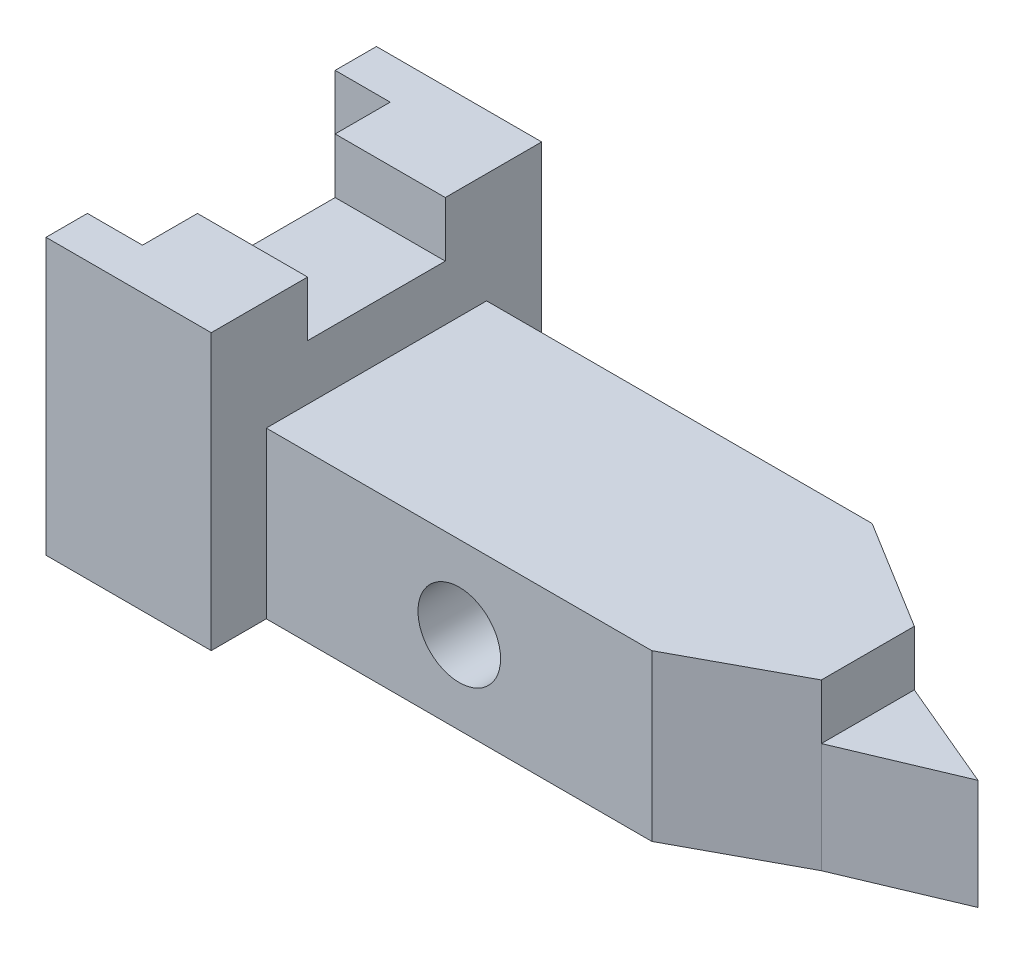
ISO-10303-21;
HEADER;
FILE_DESCRIPTION(('STEP AP214'),'2;1');
FILE_NAME('part.step','',(''),(''),'','','');
FILE_SCHEMA(('AUTOMOTIVE_DESIGN { 1 0 10303 214 1 1 1 1 }'));
ENDSEC;
DATA;
#1=APPLICATION_CONTEXT('core data for automotive mechanical design processes');
#2=APPLICATION_PROTOCOL_DEFINITION('international standard','automotive_design',2000,#1);
#3=PRODUCT_CONTEXT('',#1,'mechanical');
#4=PRODUCT('Part','Part','',(#3));
#5=PRODUCT_RELATED_PRODUCT_CATEGORY('part','',(#4));
#6=PRODUCT_DEFINITION_FORMATION('','',#4);
#7=PRODUCT_DEFINITION_CONTEXT('part definition',#1,'design');
#8=PRODUCT_DEFINITION('design','',#6,#7);
#9=PRODUCT_DEFINITION_SHAPE('','',#8);
#10=(LENGTH_UNIT() NAMED_UNIT(*) SI_UNIT(.MILLI.,.METRE.));
#11=(NAMED_UNIT(*) PLANE_ANGLE_UNIT() SI_UNIT($,.RADIAN.));
#12=(NAMED_UNIT(*) SI_UNIT($,.STERADIAN.) SOLID_ANGLE_UNIT());
#13=UNCERTAINTY_MEASURE_WITH_UNIT(LENGTH_MEASURE(1.E-05),#10,'distance_accuracy_value','');
#14=(GEOMETRIC_REPRESENTATION_CONTEXT(3) GLOBAL_UNCERTAINTY_ASSIGNED_CONTEXT((#13)) GLOBAL_UNIT_ASSIGNED_CONTEXT((#10,
#11,#12)) REPRESENTATION_CONTEXT('',''));
#15=CARTESIAN_POINT('',(0.,0.,0.));
#16=DIRECTION('',(0.,0.,1.));
#17=DIRECTION('',(1.,0.,0.));
#18=AXIS2_PLACEMENT_3D('',#15,#16,#17);
#19=CARTESIAN_POINT('',(-30.,-50.,-8.98203592814371));
#20=DIRECTION('',(-1.,0.,0.));
#21=DIRECTION('',(0.,0.,1.));
#22=AXIS2_PLACEMENT_3D('',#19,#20,#21);
#23=PLANE('',#22);
#24=DIRECTION('',(0.,0.,1.));
#25=VECTOR('',#24,1.);
#26=CARTESIAN_POINT('',(-30.,-50.,-8.98203592814371));
#27=LINE('',#26,#25);
#28=CARTESIAN_POINT('',(-30.,-50.,-8.98203592814371));
#29=VERTEX_POINT('',#28);
#30=CARTESIAN_POINT('',(-30.,-50.,-1.48203592814371));
#31=VERTEX_POINT('',#30);
#32=EDGE_CURVE('E208',#29,#31,#27,.T.);
#33=ORIENTED_EDGE('',*,*,#32,.T.);
#34=DIRECTION('',(0.,1.,0.));
#35=VECTOR('',#34,1.);
#36=CARTESIAN_POINT('',(-30.,-10.,-1.48203592814371));
#37=LINE('',#36,#35);
#38=CARTESIAN_POINT('',(-30.,0.,-1.48203592814371));
#39=VERTEX_POINT('',#38);
#40=EDGE_CURVE('E191',#31,#39,#37,.T.);
#41=ORIENTED_EDGE('',*,*,#40,.T.);
#42=DIRECTION('',(0.,0.,1.));
#43=VECTOR('',#42,1.);
#44=CARTESIAN_POINT('',(-30.,0.,-8.98203592814371));
#45=LINE('',#44,#43);
#46=CARTESIAN_POINT('',(-30.,0.,-8.98203592814371));
#47=VERTEX_POINT('',#46);
#48=EDGE_CURVE('E233',#47,#39,#45,.T.);
#49=ORIENTED_EDGE('',*,*,#48,.F.);
#50=DIRECTION('',(0.,1.,0.));
#51=VECTOR('',#50,1.);
#52=CARTESIAN_POINT('',(-30.,-50.,-8.98203592814371));
#53=LINE('',#52,#51);
#54=EDGE_CURVE('E245',#29,#47,#53,.T.);
#55=ORIENTED_EDGE('',*,*,#54,.F.);
#56=EDGE_LOOP('',(#33,#41,#49,#55));
#57=FACE_BOUND('',#56,.T.);
#58=ADVANCED_FACE('F41',(#57),#23,.T.);
#59=DIRECTION('',(0.,1.,0.));
#60=VECTOR('',#59,1.);
#61=CARTESIAN_POINT('',(-30.,-10.,43.5015247734227));
#62=LINE('',#61,#60);
#63=CARTESIAN_POINT('',(-30.,-50.,43.5015247734227));
#64=VERTEX_POINT('',#63);
#65=CARTESIAN_POINT('',(-30.,0.,43.5015247734227));
#66=VERTEX_POINT('',#65);
#67=EDGE_CURVE('E179',#64,#66,#62,.T.);
#68=ORIENTED_EDGE('',*,*,#67,.F.);
#69=CARTESIAN_POINT('',(-30.,-50.,51.0179640718563));
#70=VERTEX_POINT('',#69);
#71=EDGE_CURVE('E183',#64,#70,#27,.T.);
#72=ORIENTED_EDGE('',*,*,#71,.T.);
#73=DIRECTION('',(0.,1.,0.));
#74=VECTOR('',#73,1.);
#75=CARTESIAN_POINT('',(-30.,-50.,51.0179640718563));
#76=LINE('',#75,#74);
#77=CARTESIAN_POINT('',(-30.,0.,51.0179640718563));
#78=VERTEX_POINT('',#77);
#79=EDGE_CURVE('E232',#70,#78,#76,.T.);
#80=ORIENTED_EDGE('',*,*,#79,.T.);
#81=EDGE_CURVE('E185',#66,#78,#45,.T.);
#82=ORIENTED_EDGE('',*,*,#81,.F.);
#83=EDGE_LOOP('',(#68,#72,#80,#82));
#84=FACE_BOUND('',#83,.T.);
#85=ADVANCED_FACE('F43',(#84),#23,.T.);
#86=CARTESIAN_POINT('',(0.,0.,0.));
#87=DIRECTION('',(0.,1.,0.));
#88=DIRECTION('',(0.,0.,1.));
#89=AXIS2_PLACEMENT_3D('',#86,#87,#88);
#90=PLANE('',#89);
#91=DIRECTION('',(1.,0.,0.));
#92=VECTOR('',#91,1.);
#93=CARTESIAN_POINT('',(0.,0.,33.5179640718563));
#94=LINE('',#93,#92);
#95=CARTESIAN_POINT('',(-20.,0.,33.5179640718563));
#96=VERTEX_POINT('',#95);
#97=CARTESIAN_POINT('',(0.,0.,33.5179640718563));
#98=VERTEX_POINT('',#97);
#99=EDGE_CURVE('E404',#96,#98,#94,.T.);
#100=ORIENTED_EDGE('',*,*,#99,.F.);
#101=DIRECTION('',(0.,0.,1.));
#102=VECTOR('',#101,1.);
#103=CARTESIAN_POINT('',(-20.,0.,0.));
#104=LINE('',#103,#102);
#105=CARTESIAN_POINT('',(-20.,0.,43.5015247734227));
#106=VERTEX_POINT('',#105);
#107=EDGE_CURVE('E407',#96,#106,#104,.T.);
#108=ORIENTED_EDGE('',*,*,#107,.T.);
#109=DIRECTION('',(-1.,0.,0.));
#110=VECTOR('',#109,1.);
#111=CARTESIAN_POINT('',(0.,0.,43.5015247734227));
#112=LINE('',#111,#110);
#113=EDGE_CURVE('E411',#106,#66,#112,.T.);
#114=ORIENTED_EDGE('',*,*,#113,.T.);
#115=ORIENTED_EDGE('',*,*,#81,.T.);
#116=DIRECTION('',(1.,0.,0.));
#117=VECTOR('',#116,1.);
#118=CARTESIAN_POINT('',(-30.,0.,51.0179640718563));
#119=LINE('',#118,#117);
#120=CARTESIAN_POINT('',(0.,0.,51.0179640718563));
#121=VERTEX_POINT('',#120);
#122=EDGE_CURVE('E237',#78,#121,#119,.T.);
#123=ORIENTED_EDGE('',*,*,#122,.T.);
#124=DIRECTION('',(0.,0.,-1.));
#125=VECTOR('',#124,1.);
#126=CARTESIAN_POINT('',(0.,0.,-8.98203592814371));
#127=LINE('',#126,#125);
#128=EDGE_CURVE('E215',#121,#98,#127,.T.);
#129=ORIENTED_EDGE('',*,*,#128,.T.);
#130=EDGE_LOOP('',(#100,#108,#114,#115,#123,#129));
#131=FACE_BOUND('',#130,.T.);
#132=ADVANCED_FACE('F443',(#131),#90,.T.);
#133=CARTESIAN_POINT('',(-30.,-50.,-8.98203592814371));
#134=DIRECTION('',(0.,0.,-1.));
#135=DIRECTION('',(-1.,0.,0.));
#136=AXIS2_PLACEMENT_3D('',#133,#134,#135);
#137=PLANE('',#136);
#138=DIRECTION('',(-1.,0.,0.));
#139=VECTOR('',#138,1.);
#140=CARTESIAN_POINT('',(-30.,0.,-8.98203592814371));
#141=LINE('',#140,#139);
#142=CARTESIAN_POINT('',(0.,0.,-8.98203592814371));
#143=VERTEX_POINT('',#142);
#144=EDGE_CURVE('E209',#143,#47,#141,.T.);
#145=ORIENTED_EDGE('',*,*,#144,.F.);
#146=DIRECTION('',(0.,1.,0.));
#147=VECTOR('',#146,1.);
#148=CARTESIAN_POINT('',(0.,-50.,-8.98203592814371));
#149=LINE('',#148,#147);
#150=CARTESIAN_POINT('',(0.,-50.,-8.98203592814371));
#151=VERTEX_POINT('',#150);
#152=EDGE_CURVE('E249',#151,#143,#149,.T.);
#153=ORIENTED_EDGE('',*,*,#152,.F.);
#154=DIRECTION('',(-1.,0.,0.));
#155=VECTOR('',#154,1.);
#156=CARTESIAN_POINT('',(-30.,-50.,-8.98203592814371));
#157=LINE('',#156,#155);
#158=EDGE_CURVE('E228',#151,#29,#157,.T.);
#159=ORIENTED_EDGE('',*,*,#158,.T.);
#160=ORIENTED_EDGE('',*,*,#54,.T.);
#161=EDGE_LOOP('',(#145,#153,#159,#160));
#162=FACE_BOUND('',#161,.T.);
#163=ADVANCED_FACE('F281',(#162),#137,.T.);
#164=CARTESIAN_POINT('',(0.,-50.,-8.98203592814371));
#165=DIRECTION('',(1.,0.,0.));
#166=DIRECTION('',(0.,0.,-1.));
#167=AXIS2_PLACEMENT_3D('',#164,#165,#166);
#168=PLANE('',#167);
#169=DIRECTION('',(0.,1.,0.));
#170=VECTOR('',#169,1.);
#171=CARTESIAN_POINT('',(0.,-10.,8.51796407185629));
#172=LINE('',#171,#170);
#173=CARTESIAN_POINT('',(0.,-10.,8.51796407185629));
#174=VERTEX_POINT('',#173);
#175=CARTESIAN_POINT('',(0.,0.,8.51796407185629));
#176=VERTEX_POINT('',#175);
#177=EDGE_CURVE('E374',#174,#176,#172,.T.);
#178=ORIENTED_EDGE('',*,*,#177,.F.);
#179=DIRECTION('',(0.,0.,-1.));
#180=VECTOR('',#179,1.);
#181=CARTESIAN_POINT('',(0.,-10.,0.));
#182=LINE('',#181,#180);
#183=CARTESIAN_POINT('',(0.,-10.,33.5179640718563));
#184=VERTEX_POINT('',#183);
#185=EDGE_CURVE('E395',#184,#174,#182,.T.);
#186=ORIENTED_EDGE('',*,*,#185,.F.);
#187=DIRECTION('',(0.,1.,0.));
#188=VECTOR('',#187,1.);
#189=CARTESIAN_POINT('',(0.,-10.,33.5179640718563));
#190=LINE('',#189,#188);
#191=EDGE_CURVE('E377',#184,#98,#190,.T.);
#192=ORIENTED_EDGE('',*,*,#191,.T.);
#193=ORIENTED_EDGE('',*,*,#128,.F.);
#194=DIRECTION('',(0.,1.,0.));
#195=VECTOR('',#194,1.);
#196=CARTESIAN_POINT('',(0.,-50.,51.0179640718563));
#197=LINE('',#196,#195);
#198=CARTESIAN_POINT('',(0.,-50.,51.0179640718563));
#199=VERTEX_POINT('',#198);
#200=EDGE_CURVE('E253',#199,#121,#197,.T.);
#201=ORIENTED_EDGE('',*,*,#200,.F.);
#202=DIRECTION('',(0.,0.,-1.));
#203=VECTOR('',#202,1.);
#204=CARTESIAN_POINT('',(0.,-50.,-8.98203592814371));
#205=LINE('',#204,#203);
#206=CARTESIAN_POINT('',(0.,-50.,41.0179640718563));
#207=VERTEX_POINT('',#206);
#208=EDGE_CURVE('E224',#199,#207,#205,.T.);
#209=ORIENTED_EDGE('',*,*,#208,.T.);
#210=DIRECTION('',(0.,-1.,0.));
#211=VECTOR('',#210,1.);
#212=CARTESIAN_POINT('',(0.,-50.,41.0179640718563));
#213=LINE('',#212,#211);
#214=CARTESIAN_POINT('',(0.,-20.,41.0179640718563));
#215=VERTEX_POINT('',#214);
#216=EDGE_CURVE('E309',#215,#207,#213,.T.);
#217=ORIENTED_EDGE('',*,*,#216,.F.);
#218=DIRECTION('',(0.,0.,1.));
#219=VECTOR('',#218,1.);
#220=CARTESIAN_POINT('',(0.,-20.,41.0179640718563));
#221=LINE('',#220,#219);
#222=CARTESIAN_POINT('',(0.,-20.,1.01796407185629));
#223=VERTEX_POINT('',#222);
#224=EDGE_CURVE('E313',#223,#215,#221,.T.);
#225=ORIENTED_EDGE('',*,*,#224,.F.);
#226=DIRECTION('',(0.,1.,0.));
#227=VECTOR('',#226,1.);
#228=CARTESIAN_POINT('',(0.,-20.,1.01796407185629));
#229=LINE('',#228,#227);
#230=CARTESIAN_POINT('',(0.,-50.,1.01796407185628));
#231=VERTEX_POINT('',#230);
#232=EDGE_CURVE('E277',#231,#223,#229,.T.);
#233=ORIENTED_EDGE('',*,*,#232,.F.);
#234=EDGE_CURVE('E223',#231,#151,#205,.T.);
#235=ORIENTED_EDGE('',*,*,#234,.T.);
#236=ORIENTED_EDGE('',*,*,#152,.T.);
#237=EDGE_CURVE('E241',#176,#143,#127,.T.);
#238=ORIENTED_EDGE('',*,*,#237,.F.);
#239=EDGE_LOOP('',(#178,#186,#192,#193,#201,#209,#217,#225,#233,#235,#236,#238));
#240=FACE_BOUND('',#239,.T.);
#241=ADVANCED_FACE('F272',(#240),#168,.T.);
#242=CARTESIAN_POINT('',(-30.,-50.,51.0179640718563));
#243=DIRECTION('',(0.,0.,1.));
#244=DIRECTION('',(1.,0.,0.));
#245=AXIS2_PLACEMENT_3D('',#242,#243,#244);
#246=PLANE('',#245);
#247=ORIENTED_EDGE('',*,*,#122,.F.);
#248=ORIENTED_EDGE('',*,*,#79,.F.);
#249=DIRECTION('',(1.,0.,0.));
#250=VECTOR('',#249,1.);
#251=CARTESIAN_POINT('',(-30.,-50.,51.0179640718563));
#252=LINE('',#251,#250);
#253=EDGE_CURVE('E206',#70,#199,#252,.T.);
#254=ORIENTED_EDGE('',*,*,#253,.T.);
#255=ORIENTED_EDGE('',*,*,#200,.T.);
#256=EDGE_LOOP('',(#247,#248,#254,#255));
#257=FACE_BOUND('',#256,.T.);
#258=ADVANCED_FACE('F464',(#257),#246,.T.);
#259=CARTESIAN_POINT('',(0.,-50.,0.));
#260=DIRECTION('',(0.,1.,0.));
#261=DIRECTION('',(0.,0.,1.));
#262=AXIS2_PLACEMENT_3D('',#259,#260,#261);
#263=PLANE('',#262);
#264=DIRECTION('',(0.,0.,-1.));
#265=VECTOR('',#264,1.);
#266=CARTESIAN_POINT('',(-20.,-50.,0.));
#267=LINE('',#266,#265);
#268=CARTESIAN_POINT('',(-20.,-50.,43.5015247734227));
#269=VERTEX_POINT('',#268);
#270=CARTESIAN_POINT('',(-20.,-50.,-1.48203592814371));
#271=VERTEX_POINT('',#270);
#272=EDGE_CURVE('E200',#269,#271,#267,.T.);
#273=ORIENTED_EDGE('',*,*,#272,.T.);
#274=DIRECTION('',(-1.,0.,0.));
#275=VECTOR('',#274,1.);
#276=CARTESIAN_POINT('',(0.,-50.,-1.48203592814371));
#277=LINE('',#276,#275);
#278=EDGE_CURVE('E285',#271,#31,#277,.T.);
#279=ORIENTED_EDGE('',*,*,#278,.T.);
#280=ORIENTED_EDGE('',*,*,#32,.F.);
#281=ORIENTED_EDGE('',*,*,#158,.F.);
#282=ORIENTED_EDGE('',*,*,#234,.F.);
#283=DIRECTION('',(-1.,0.,0.));
#284=VECTOR('',#283,1.);
#285=CARTESIAN_POINT('',(90.,-50.,1.01796407185627));
#286=LINE('',#285,#284);
#287=CARTESIAN_POINT('',(70.,-50.,1.01796407185627));
#288=VERTEX_POINT('',#287);
#289=EDGE_CURVE('E219',#288,#231,#286,.T.);
#290=ORIENTED_EDGE('',*,*,#289,.F.);
#291=DIRECTION('',(0.851136331949679,0.,0.524944706074122));
#292=VECTOR('',#291,1.);
#293=CARTESIAN_POINT('',(18.8348602603311,-50.,-30.5385189892732));
#294=LINE('',#293,#292);
#295=CARTESIAN_POINT('',(90.,-50.,13.3531138326858));
#296=VERTEX_POINT('',#295);
#297=EDGE_CURVE('E327',#288,#296,#294,.T.);
#298=ORIENTED_EDGE('',*,*,#297,.T.);
#299=DIRECTION('',(0.92132308126387,0.,0.388797865131032));
#300=VECTOR('',#299,1.);
#301=CARTESIAN_POINT('',(8.8215420239001,-50.,-20.9041535663249));
#302=LINE('',#301,#300);
#303=CARTESIAN_POINT('',(110.,-50.,21.7931035179042));
#304=VERTEX_POINT('',#303);
#305=EDGE_CURVE('E357',#296,#304,#302,.T.);
#306=ORIENTED_EDGE('',*,*,#305,.T.);
#307=DIRECTION('',(-0.92132308126387,0.,0.388797865131032));
#308=VECTOR('',#307,1.);
#309=CARTESIAN_POINT('',(24.4344895607985,-50.,57.9017047937693));
#310=LINE('',#309,#308);
#311=CARTESIAN_POINT('',(90.,-50.,30.2330932031225));
#312=VERTEX_POINT('',#311);
#313=EDGE_CURVE('E364',#304,#312,#310,.T.);
#314=ORIENTED_EDGE('',*,*,#313,.T.);
#315=DIRECTION('',(-0.880183617017183,0.,0.474633332515268));
#316=VECTOR('',#315,1.);
#317=CARTESIAN_POINT('',(32.9052245927952,-50.,61.0210822054256));
#318=LINE('',#317,#316);
#319=CARTESIAN_POINT('',(70.,-50.,41.0179640718563));
#320=VERTEX_POINT('',#319);
#321=EDGE_CURVE('E331',#312,#320,#318,.T.);
#322=ORIENTED_EDGE('',*,*,#321,.T.);
#323=DIRECTION('',(-1.,0.,0.));
#324=VECTOR('',#323,1.);
#325=CARTESIAN_POINT('',(90.,-50.,41.0179640718563));
#326=LINE('',#325,#324);
#327=EDGE_CURVE('E303',#320,#207,#326,.T.);
#328=ORIENTED_EDGE('',*,*,#327,.T.);
#329=ORIENTED_EDGE('',*,*,#208,.F.);
#330=ORIENTED_EDGE('',*,*,#253,.F.);
#331=ORIENTED_EDGE('',*,*,#71,.F.);
#332=DIRECTION('',(1.,0.,0.));
#333=VECTOR('',#332,1.);
#334=CARTESIAN_POINT('',(0.,-50.,43.5015247734227));
#335=LINE('',#334,#333);
#336=EDGE_CURVE('E194',#64,#269,#335,.T.);
#337=ORIENTED_EDGE('',*,*,#336,.T.);
#338=EDGE_LOOP('',(#273,#279,#280,#281,#282,#290,#298,#306,#314,#322,#328,#329,#330,#331,#337));
#339=FACE_BOUND('',#338,.T.);
#340=ADVANCED_FACE('F203',(#339),#263,.F.);
#341=DIRECTION('',(-1.,0.,0.));
#342=VECTOR('',#341,1.);
#343=CARTESIAN_POINT('',(0.,0.,8.51796407185629));
#344=LINE('',#343,#342);
#345=CARTESIAN_POINT('',(-20.,0.,8.51796407185629));
#346=VERTEX_POINT('',#345);
#347=EDGE_CURVE('E294',#176,#346,#344,.T.);
#348=ORIENTED_EDGE('',*,*,#347,.F.);
#349=ORIENTED_EDGE('',*,*,#237,.T.);
#350=ORIENTED_EDGE('',*,*,#144,.T.);
#351=ORIENTED_EDGE('',*,*,#48,.T.);
#352=DIRECTION('',(-1.,0.,0.));
#353=VECTOR('',#352,1.);
#354=CARTESIAN_POINT('',(0.,0.,-1.48203592814371));
#355=LINE('',#354,#353);
#356=CARTESIAN_POINT('',(-20.,0.,-1.48203592814371));
#357=VERTEX_POINT('',#356);
#358=EDGE_CURVE('E414',#357,#39,#355,.T.);
#359=ORIENTED_EDGE('',*,*,#358,.F.);
#360=DIRECTION('',(0.,0.,-1.));
#361=VECTOR('',#360,1.);
#362=CARTESIAN_POINT('',(-20.,0.,0.));
#363=LINE('',#362,#361);
#364=EDGE_CURVE('E57',#346,#357,#363,.T.);
#365=ORIENTED_EDGE('',*,*,#364,.F.);
#366=EDGE_LOOP('',(#348,#349,#350,#351,#359,#365));
#367=FACE_BOUND('',#366,.T.);
#368=ADVANCED_FACE('F292',(#367),#90,.T.);
#369=CARTESIAN_POINT('',(90.,-20.,1.01796407185628));
#370=DIRECTION('',(0.,0.,1.));
#371=DIRECTION('',(0.,-1.,0.));
#372=AXIS2_PLACEMENT_3D('',#369,#370,#371);
#373=PLANE('',#372);
#374=CARTESIAN_POINT('',(35.0369015857406,-35.,1.01796407185628));
#375=DIRECTION('',(0.,0.,1.));
#376=DIRECTION('',(0.,-1.,0.));
#377=AXIS2_PLACEMENT_3D('',#374,#375,#376);
#378=CIRCLE('',#377,7.5);
#379=CARTESIAN_POINT('',(35.0369015857406,-42.5,1.01796407185628));
#380=VERTEX_POINT('',#379);
#381=EDGE_CURVE('E319',#380,#380,#378,.T.);
#382=ORIENTED_EDGE('',*,*,#381,.T.);
#383=EDGE_LOOP('',(#382));
#384=FACE_BOUND('',#383,.T.);
#385=DIRECTION('',(-1.,0.,0.));
#386=VECTOR('',#385,1.);
#387=CARTESIAN_POINT('',(90.,-20.,1.01796407185628));
#388=LINE('',#387,#386);
#389=CARTESIAN_POINT('',(70.,-20.,1.01796407185627));
#390=VERTEX_POINT('',#389);
#391=EDGE_CURVE('E299',#390,#223,#388,.T.);
#392=ORIENTED_EDGE('',*,*,#391,.F.);
#393=DIRECTION('',(0.,1.,0.));
#394=VECTOR('',#393,1.);
#395=CARTESIAN_POINT('',(70.,-110.,1.01796407185627));
#396=LINE('',#395,#394);
#397=EDGE_CURVE('E335',#288,#390,#396,.T.);
#398=ORIENTED_EDGE('',*,*,#397,.F.);
#399=ORIENTED_EDGE('',*,*,#289,.T.);
#400=ORIENTED_EDGE('',*,*,#232,.T.);
#401=EDGE_LOOP('',(#392,#398,#399,#400));
#402=FACE_BOUND('',#401,.T.);
#403=ADVANCED_FACE('F456',(#384,#402),#373,.F.);
#404=CARTESIAN_POINT('',(90.,-20.,41.0179640718563));
#405=DIRECTION('',(0.,-1.,0.));
#406=DIRECTION('',(0.,0.,-1.));
#407=AXIS2_PLACEMENT_3D('',#404,#405,#406);
#408=PLANE('',#407);
#409=DIRECTION('',(0.,0.,1.));
#410=VECTOR('',#409,1.);
#411=CARTESIAN_POINT('',(90.,-20.,41.0179640718563));
#412=LINE('',#411,#410);
#413=CARTESIAN_POINT('',(90.,-20.,13.3531138326858));
#414=VERTEX_POINT('',#413);
#415=CARTESIAN_POINT('',(90.,-20.,30.2330932031225));
#416=VERTEX_POINT('',#415);
#417=EDGE_CURVE('E306',#414,#416,#412,.T.);
#418=ORIENTED_EDGE('',*,*,#417,.F.);
#419=DIRECTION('',(0.851136331949679,0.,0.524944706074122));
#420=VECTOR('',#419,1.);
#421=CARTESIAN_POINT('',(70.,-20.,1.01796407185627));
#422=LINE('',#421,#420);
#423=EDGE_CURVE('E338',#390,#414,#422,.T.);
#424=ORIENTED_EDGE('',*,*,#423,.F.);
#425=ORIENTED_EDGE('',*,*,#391,.T.);
#426=ORIENTED_EDGE('',*,*,#224,.T.);
#427=DIRECTION('',(-1.,0.,0.));
#428=VECTOR('',#427,1.);
#429=CARTESIAN_POINT('',(90.,-20.,41.0179640718563));
#430=LINE('',#429,#428);
#431=CARTESIAN_POINT('',(70.,-20.,41.0179640718563));
#432=VERTEX_POINT('',#431);
#433=EDGE_CURVE('E301',#432,#215,#430,.T.);
#434=ORIENTED_EDGE('',*,*,#433,.F.);
#435=DIRECTION('',(-0.880183617017183,0.,0.474633332515268));
#436=VECTOR('',#435,1.);
#437=CARTESIAN_POINT('',(70.,-20.,41.0179640718563));
#438=LINE('',#437,#436);
#439=EDGE_CURVE('E345',#416,#432,#438,.T.);
#440=ORIENTED_EDGE('',*,*,#439,.F.);
#441=EDGE_LOOP('',(#418,#424,#425,#426,#434,#440));
#442=FACE_BOUND('',#441,.T.);
#443=ADVANCED_FACE('F461',(#442),#408,.F.);
#444=CARTESIAN_POINT('',(90.,-50.,41.0179640718563));
#445=DIRECTION('',(0.,0.,-1.));
#446=DIRECTION('',(-1.,0.,0.));
#447=AXIS2_PLACEMENT_3D('',#444,#445,#446);
#448=PLANE('',#447);
#449=CARTESIAN_POINT('',(35.0369015857406,-35.,41.0179640718563));
#450=DIRECTION('',(0.,0.,1.));
#451=DIRECTION('',(1.,0.,0.));
#452=AXIS2_PLACEMENT_3D('',#449,#450,#451);
#453=CIRCLE('',#452,7.5);
#454=CARTESIAN_POINT('',(42.5369015857406,-35.,41.0179640718563));
#455=VERTEX_POINT('',#454);
#456=EDGE_CURVE('E323',#455,#455,#453,.T.);
#457=ORIENTED_EDGE('',*,*,#456,.F.);
#458=EDGE_LOOP('',(#457));
#459=FACE_BOUND('',#458,.T.);
#460=ORIENTED_EDGE('',*,*,#327,.F.);
#461=DIRECTION('',(0.,1.,0.));
#462=VECTOR('',#461,1.);
#463=CARTESIAN_POINT('',(70.,-110.,41.0179640718563));
#464=LINE('',#463,#462);
#465=EDGE_CURVE('E341',#320,#432,#464,.T.);
#466=ORIENTED_EDGE('',*,*,#465,.T.);
#467=ORIENTED_EDGE('',*,*,#433,.T.);
#468=ORIENTED_EDGE('',*,*,#216,.T.);
#469=EDGE_LOOP('',(#460,#466,#467,#468));
#470=FACE_BOUND('',#469,.T.);
#471=ADVANCED_FACE('F472',(#459,#470),#448,.F.);
#472=CARTESIAN_POINT('',(90.,0.,0.));
#473=DIRECTION('',(-1.,0.,0.));
#474=DIRECTION('',(0.,0.,1.));
#475=AXIS2_PLACEMENT_3D('',#472,#473,#474);
#476=PLANE('',#475);
#477=DIRECTION('',(0.,-1.,0.));
#478=VECTOR('',#477,1.);
#479=CARTESIAN_POINT('',(90.,0.,30.2330932031225));
#480=LINE('',#479,#478);
#481=CARTESIAN_POINT('',(90.,-30.,30.2330932031225));
#482=VERTEX_POINT('',#481);
#483=EDGE_CURVE('E248',#416,#482,#480,.T.);
#484=ORIENTED_EDGE('',*,*,#483,.T.);
#485=DIRECTION('',(0.,0.,-1.));
#486=VECTOR('',#485,1.);
#487=CARTESIAN_POINT('',(90.,-30.,0.));
#488=LINE('',#487,#486);
#489=CARTESIAN_POINT('',(90.,-30.,13.3531138326858));
#490=VERTEX_POINT('',#489);
#491=EDGE_CURVE('E351',#482,#490,#488,.T.);
#492=ORIENTED_EDGE('',*,*,#491,.T.);
#493=DIRECTION('',(0.,1.,0.));
#494=VECTOR('',#493,1.);
#495=CARTESIAN_POINT('',(90.,0.,13.3531138326858));
#496=LINE('',#495,#494);
#497=EDGE_CURVE('E65',#490,#414,#496,.T.);
#498=ORIENTED_EDGE('',*,*,#497,.T.);
#499=ORIENTED_EDGE('',*,*,#417,.T.);
#500=EDGE_LOOP('',(#484,#492,#498,#499));
#501=FACE_BOUND('',#500,.T.);
#502=ADVANCED_FACE('F476',(#501),#476,.F.);
#503=CARTESIAN_POINT('',(35.0369015857406,-35.,-48.9820359281437));
#504=DIRECTION('',(0.,0.,1.));
#505=DIRECTION('',(1.,0.,0.));
#506=AXIS2_PLACEMENT_3D('',#503,#504,#505);
#507=CYLINDRICAL_SURFACE('',#506,7.5);
#508=ORIENTED_EDGE('',*,*,#456,.T.);
#509=EDGE_LOOP('',(#508));
#510=FACE_BOUND('',#509,.T.);
#511=ORIENTED_EDGE('',*,*,#381,.F.);
#512=EDGE_LOOP('',(#511));
#513=FACE_BOUND('',#512,.T.);
#514=ADVANCED_FACE('F480',(#510,#513),#507,.F.);
#515=CARTESIAN_POINT('',(70.,-110.,41.0179640718563));
#516=DIRECTION('',(-0.474633332515268,0.,-0.880183617017183));
#517=DIRECTION('',(-0.880183617017183,0.,0.474633332515268));
#518=AXIS2_PLACEMENT_3D('',#515,#516,#517);
#519=PLANE('',#518);
#520=ORIENTED_EDGE('',*,*,#483,.F.);
#521=ORIENTED_EDGE('',*,*,#439,.T.);
#522=ORIENTED_EDGE('',*,*,#465,.F.);
#523=ORIENTED_EDGE('',*,*,#321,.F.);
#524=DIRECTION('',(0.,-1.,0.));
#525=VECTOR('',#524,1.);
#526=CARTESIAN_POINT('',(90.,0.,30.2330932031225));
#527=LINE('',#526,#525);
#528=EDGE_CURVE('E348',#482,#312,#527,.T.);
#529=ORIENTED_EDGE('',*,*,#528,.F.);
#530=EDGE_LOOP('',(#520,#521,#522,#523,#529));
#531=FACE_BOUND('',#530,.T.);
#532=ADVANCED_FACE('F483',(#531),#519,.F.);
#533=CARTESIAN_POINT('',(70.,-110.,1.01796407185627));
#534=DIRECTION('',(-0.524944706074122,0.,0.851136331949679));
#535=DIRECTION('',(0.851136331949679,0.,0.524944706074122));
#536=AXIS2_PLACEMENT_3D('',#533,#534,#535);
#537=PLANE('',#536);
#538=ORIENTED_EDGE('',*,*,#397,.T.);
#539=ORIENTED_EDGE('',*,*,#423,.T.);
#540=ORIENTED_EDGE('',*,*,#497,.F.);
#541=EDGE_CURVE('E50',#296,#490,#496,.T.);
#542=ORIENTED_EDGE('',*,*,#541,.F.);
#543=ORIENTED_EDGE('',*,*,#297,.F.);
#544=EDGE_LOOP('',(#538,#539,#540,#542,#543));
#545=FACE_BOUND('',#544,.T.);
#546=ADVANCED_FACE('F487',(#545),#537,.F.);
#547=CARTESIAN_POINT('',(110.,-30.,0.));
#548=DIRECTION('',(0.,1.,0.));
#549=DIRECTION('',(-1.,0.,0.));
#550=AXIS2_PLACEMENT_3D('',#547,#548,#549);
#551=PLANE('',#550);
#552=DIRECTION('',(-0.92132308126387,0.,0.388797865131032));
#553=VECTOR('',#552,1.);
#554=CARTESIAN_POINT('',(24.4344895607985,-30.,57.9017047937693));
#555=LINE('',#554,#553);
#556=CARTESIAN_POINT('',(110.,-30.,21.7931035179042));
#557=VERTEX_POINT('',#556);
#558=EDGE_CURVE('E368',#557,#482,#555,.T.);
#559=ORIENTED_EDGE('',*,*,#558,.F.);
#560=DIRECTION('',(0.92132308126387,0.,0.388797865131032));
#561=VECTOR('',#560,1.);
#562=CARTESIAN_POINT('',(8.8215420239001,-30.,-20.9041535663249));
#563=LINE('',#562,#561);
#564=EDGE_CURVE('E361',#490,#557,#563,.T.);
#565=ORIENTED_EDGE('',*,*,#564,.F.);
#566=ORIENTED_EDGE('',*,*,#491,.F.);
#567=EDGE_LOOP('',(#559,#565,#566));
#568=FACE_BOUND('',#567,.T.);
#569=ADVANCED_FACE('F491',(#568),#551,.T.);
#570=CARTESIAN_POINT('',(8.8215420239001,-50.,-20.9041535663249));
#571=DIRECTION('',(-0.388797865131032,0.,0.92132308126387));
#572=DIRECTION('',(0.92132308126387,0.,0.388797865131032));
#573=AXIS2_PLACEMENT_3D('',#570,#571,#572);
#574=PLANE('',#573);
#575=ORIENTED_EDGE('',*,*,#564,.T.);
#576=DIRECTION('',(0.,1.,0.));
#577=VECTOR('',#576,1.);
#578=CARTESIAN_POINT('',(110.,-50.,21.7931035179042));
#579=LINE('',#578,#577);
#580=EDGE_CURVE('E354',#304,#557,#579,.T.);
#581=ORIENTED_EDGE('',*,*,#580,.F.);
#582=ORIENTED_EDGE('',*,*,#305,.F.);
#583=ORIENTED_EDGE('',*,*,#541,.T.);
#584=EDGE_LOOP('',(#575,#581,#582,#583));
#585=FACE_BOUND('',#584,.T.);
#586=ADVANCED_FACE('F495',(#585),#574,.F.);
#587=CARTESIAN_POINT('',(24.4344895607985,-50.,57.9017047937693));
#588=DIRECTION('',(-0.388797865131032,0.,-0.92132308126387));
#589=DIRECTION('',(-0.92132308126387,0.,0.388797865131032));
#590=AXIS2_PLACEMENT_3D('',#587,#588,#589);
#591=PLANE('',#590);
#592=ORIENTED_EDGE('',*,*,#558,.T.);
#593=ORIENTED_EDGE('',*,*,#528,.T.);
#594=ORIENTED_EDGE('',*,*,#313,.F.);
#595=ORIENTED_EDGE('',*,*,#580,.T.);
#596=EDGE_LOOP('',(#592,#593,#594,#595));
#597=FACE_BOUND('',#596,.T.);
#598=ADVANCED_FACE('F499',(#597),#591,.F.);
#599=CARTESIAN_POINT('',(-20.,-10.,0.));
#600=DIRECTION('',(1.,0.,0.));
#601=DIRECTION('',(0.,0.,-1.));
#602=AXIS2_PLACEMENT_3D('',#599,#600,#601);
#603=PLANE('',#602);
#604=ORIENTED_EDGE('',*,*,#364,.T.);
#605=DIRECTION('',(0.,1.,0.));
#606=VECTOR('',#605,1.);
#607=CARTESIAN_POINT('',(-20.,-10.,-1.48203592814371));
#608=LINE('',#607,#606);
#609=EDGE_CURVE('E388',#271,#357,#608,.T.);
#610=ORIENTED_EDGE('',*,*,#609,.F.);
#611=ORIENTED_EDGE('',*,*,#272,.F.);
#612=DIRECTION('',(0.,1.,0.));
#613=VECTOR('',#612,1.);
#614=CARTESIAN_POINT('',(-20.,-10.,43.5015247734227));
#615=LINE('',#614,#613);
#616=EDGE_CURVE('E190',#269,#106,#615,.T.);
#617=ORIENTED_EDGE('',*,*,#616,.T.);
#618=ORIENTED_EDGE('',*,*,#107,.F.);
#619=DIRECTION('',(0.,1.,0.));
#620=VECTOR('',#619,1.);
#621=CARTESIAN_POINT('',(-20.,-10.,33.5179640718563));
#622=LINE('',#621,#620);
#623=CARTESIAN_POINT('',(-20.,-10.,33.5179640718563));
#624=VERTEX_POINT('',#623);
#625=EDGE_CURVE('E381',#624,#96,#622,.T.);
#626=ORIENTED_EDGE('',*,*,#625,.F.);
#627=DIRECTION('',(0.,0.,-1.));
#628=VECTOR('',#627,1.);
#629=CARTESIAN_POINT('',(-20.,-10.,0.));
#630=LINE('',#629,#628);
#631=CARTESIAN_POINT('',(-20.,-10.,8.51796407185629));
#632=VERTEX_POINT('',#631);
#633=EDGE_CURVE('E11',#624,#632,#630,.T.);
#634=ORIENTED_EDGE('',*,*,#633,.T.);
#635=DIRECTION('',(0.,1.,0.));
#636=VECTOR('',#635,1.);
#637=CARTESIAN_POINT('',(-20.,-10.,8.51796407185629));
#638=LINE('',#637,#636);
#639=EDGE_CURVE('E371',#632,#346,#638,.T.);
#640=ORIENTED_EDGE('',*,*,#639,.T.);
#641=EDGE_LOOP('',(#604,#610,#611,#617,#618,#626,#634,#640));
#642=FACE_BOUND('',#641,.T.);
#643=ADVANCED_FACE('F423',(#642),#603,.F.);
#644=CARTESIAN_POINT('',(0.,-10.,8.51796407185629));
#645=DIRECTION('',(0.,0.,-1.));
#646=DIRECTION('',(-1.,0.,0.));
#647=AXIS2_PLACEMENT_3D('',#644,#645,#646);
#648=PLANE('',#647);
#649=ORIENTED_EDGE('',*,*,#347,.T.);
#650=ORIENTED_EDGE('',*,*,#639,.F.);
#651=DIRECTION('',(-1.,0.,0.));
#652=VECTOR('',#651,1.);
#653=CARTESIAN_POINT('',(0.,-10.,8.51796407185629));
#654=LINE('',#653,#652);
#655=EDGE_CURVE('E391',#174,#632,#654,.T.);
#656=ORIENTED_EDGE('',*,*,#655,.F.);
#657=ORIENTED_EDGE('',*,*,#177,.T.);
#658=EDGE_LOOP('',(#649,#650,#656,#657));
#659=FACE_BOUND('',#658,.T.);
#660=ADVANCED_FACE('F503',(#659),#648,.F.);
#661=CARTESIAN_POINT('',(0.,-10.,33.5179640718563));
#662=DIRECTION('',(0.,0.,1.));
#663=DIRECTION('',(1.,0.,0.));
#664=AXIS2_PLACEMENT_3D('',#661,#662,#663);
#665=PLANE('',#664);
#666=ORIENTED_EDGE('',*,*,#99,.T.);
#667=ORIENTED_EDGE('',*,*,#191,.F.);
#668=DIRECTION('',(1.,0.,0.));
#669=VECTOR('',#668,1.);
#670=CARTESIAN_POINT('',(0.,-10.,33.5179640718563));
#671=LINE('',#670,#669);
#672=EDGE_CURVE('E398',#624,#184,#671,.T.);
#673=ORIENTED_EDGE('',*,*,#672,.F.);
#674=ORIENTED_EDGE('',*,*,#625,.T.);
#675=EDGE_LOOP('',(#666,#667,#673,#674));
#676=FACE_BOUND('',#675,.T.);
#677=ADVANCED_FACE('F436',(#676),#665,.F.);
#678=CARTESIAN_POINT('',(0.,-10.,43.5015247734227));
#679=DIRECTION('',(0.,0.,-1.));
#680=DIRECTION('',(-1.,0.,0.));
#681=AXIS2_PLACEMENT_3D('',#678,#679,#680);
#682=PLANE('',#681);
#683=ORIENTED_EDGE('',*,*,#113,.F.);
#684=ORIENTED_EDGE('',*,*,#616,.F.);
#685=ORIENTED_EDGE('',*,*,#336,.F.);
#686=ORIENTED_EDGE('',*,*,#67,.T.);
#687=EDGE_LOOP('',(#683,#684,#685,#686));
#688=FACE_BOUND('',#687,.T.);
#689=ADVANCED_FACE('F195',(#688),#682,.T.);
#690=CARTESIAN_POINT('',(0.,-10.,-1.48203592814371));
#691=DIRECTION('',(0.,0.,-1.));
#692=DIRECTION('',(-1.,0.,0.));
#693=AXIS2_PLACEMENT_3D('',#690,#691,#692);
#694=PLANE('',#693);
#695=ORIENTED_EDGE('',*,*,#358,.T.);
#696=ORIENTED_EDGE('',*,*,#40,.F.);
#697=ORIENTED_EDGE('',*,*,#278,.F.);
#698=ORIENTED_EDGE('',*,*,#609,.T.);
#699=EDGE_LOOP('',(#695,#696,#697,#698));
#700=FACE_BOUND('',#699,.T.);
#701=ADVANCED_FACE('F426',(#700),#694,.F.);
#702=CARTESIAN_POINT('',(0.,-10.,0.));
#703=DIRECTION('',(0.,1.,0.));
#704=DIRECTION('',(0.,0.,1.));
#705=AXIS2_PLACEMENT_3D('',#702,#703,#704);
#706=PLANE('',#705);
#707=ORIENTED_EDGE('',*,*,#633,.F.);
#708=ORIENTED_EDGE('',*,*,#672,.T.);
#709=ORIENTED_EDGE('',*,*,#185,.T.);
#710=ORIENTED_EDGE('',*,*,#655,.T.);
#711=EDGE_LOOP('',(#707,#708,#709,#710));
#712=FACE_BOUND('',#711,.T.);
#713=ADVANCED_FACE('F428',(#712),#706,.T.);
#714=CLOSED_SHELL('',(#58,#85,#132,#163,#241,#258,#340,#368,#403,#443,#471,#502,#514,#532,#546,
#569,#586,#598,#643,#660,#677,#689,#701,#713));
#715=MANIFOLD_SOLID_BREP('B2',#714);
#716=ADVANCED_BREP_SHAPE_REPRESENTATION('',(#18,#715),#14);
#717=SHAPE_DEFINITION_REPRESENTATION(#9,#716);
ENDSEC;
END-ISO-10303-21;
